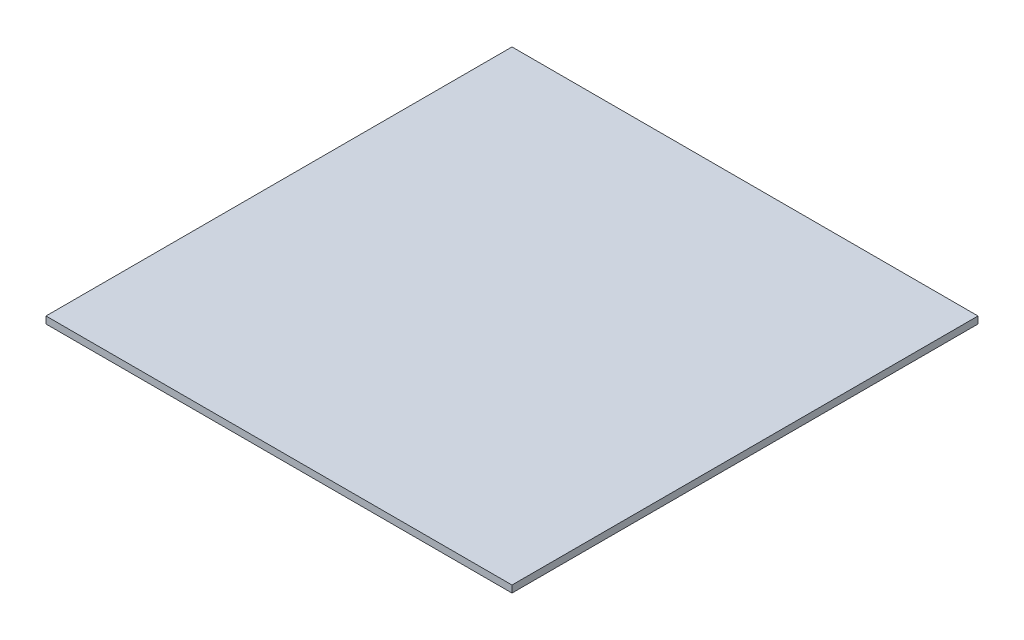
ISO-10303-21;
HEADER;
FILE_DESCRIPTION(('STEP AP214'),'2;1');
FILE_NAME('part.step','',(''),(''),'','','');
FILE_SCHEMA(('AUTOMOTIVE_DESIGN { 1 0 10303 214 1 1 1 1 }'));
ENDSEC;
DATA;
#1=APPLICATION_CONTEXT('core data for automotive mechanical design processes');
#2=APPLICATION_PROTOCOL_DEFINITION('international standard','automotive_design',2000,#1);
#3=PRODUCT_CONTEXT('',#1,'mechanical');
#4=PRODUCT('Part','Part','',(#3));
#5=PRODUCT_RELATED_PRODUCT_CATEGORY('part','',(#4));
#6=PRODUCT_DEFINITION_FORMATION('','',#4);
#7=PRODUCT_DEFINITION_CONTEXT('part definition',#1,'design');
#8=PRODUCT_DEFINITION('design','',#6,#7);
#9=PRODUCT_DEFINITION_SHAPE('','',#8);
#10=(LENGTH_UNIT() NAMED_UNIT(*) SI_UNIT(.MILLI.,.METRE.));
#11=(NAMED_UNIT(*) PLANE_ANGLE_UNIT() SI_UNIT($,.RADIAN.));
#12=(NAMED_UNIT(*) SI_UNIT($,.STERADIAN.) SOLID_ANGLE_UNIT());
#13=UNCERTAINTY_MEASURE_WITH_UNIT(LENGTH_MEASURE(1.E-05),#10,'distance_accuracy_value','');
#14=(GEOMETRIC_REPRESENTATION_CONTEXT(3) GLOBAL_UNCERTAINTY_ASSIGNED_CONTEXT((#13)) GLOBAL_UNIT_ASSIGNED_CONTEXT((#10,
#11,#12)) REPRESENTATION_CONTEXT('',''));
#15=CARTESIAN_POINT('',(0.,0.,0.));
#16=DIRECTION('',(0.,0.,1.));
#17=DIRECTION('',(1.,0.,0.));
#18=AXIS2_PLACEMENT_3D('',#15,#16,#17);
#19=CARTESIAN_POINT('',(25.4,0.762,25.4));
#20=DIRECTION('',(-1.,0.,0.));
#21=DIRECTION('',(0.,0.,1.));
#22=AXIS2_PLACEMENT_3D('',#19,#20,#21);
#23=PLANE('',#22);
#24=DIRECTION('',(0.,0.,-1.));
#25=VECTOR('',#24,1.);
#26=CARTESIAN_POINT('',(25.4,0.,25.4));
#27=LINE('',#26,#25);
#28=CARTESIAN_POINT('',(25.4,0.,25.4));
#29=VERTEX_POINT('',#28);
#30=CARTESIAN_POINT('',(25.4,0.,-25.4));
#31=VERTEX_POINT('',#30);
#32=EDGE_CURVE('E108',#29,#31,#27,.T.);
#33=ORIENTED_EDGE('',*,*,#32,.T.);
#34=DIRECTION('',(0.,-1.,0.));
#35=VECTOR('',#34,1.);
#36=CARTESIAN_POINT('',(25.4,0.762,-25.4));
#37=LINE('',#36,#35);
#38=CARTESIAN_POINT('',(25.4,0.762,-25.4));
#39=VERTEX_POINT('',#38);
#40=EDGE_CURVE('E11',#39,#31,#37,.T.);
#41=ORIENTED_EDGE('',*,*,#40,.F.);
#42=DIRECTION('',(0.,0.,-1.));
#43=VECTOR('',#42,1.);
#44=CARTESIAN_POINT('',(25.4,0.762,25.4));
#45=LINE('',#44,#43);
#46=CARTESIAN_POINT('',(25.4,0.762,25.4));
#47=VERTEX_POINT('',#46);
#48=EDGE_CURVE('E96',#47,#39,#45,.T.);
#49=ORIENTED_EDGE('',*,*,#48,.F.);
#50=DIRECTION('',(0.,-1.,0.));
#51=VECTOR('',#50,1.);
#52=CARTESIAN_POINT('',(25.4,0.762,25.4));
#53=LINE('',#52,#51);
#54=EDGE_CURVE('E104',#47,#29,#53,.T.);
#55=ORIENTED_EDGE('',*,*,#54,.T.);
#56=EDGE_LOOP('',(#33,#41,#49,#55));
#57=FACE_BOUND('',#56,.T.);
#58=ADVANCED_FACE('F45',(#57),#23,.F.);
#59=CARTESIAN_POINT('',(-25.4,0.762,-25.4));
#60=DIRECTION('',(0.,0.,1.));
#61=DIRECTION('',(1.,0.,0.));
#62=AXIS2_PLACEMENT_3D('',#59,#60,#61);
#63=PLANE('',#62);
#64=DIRECTION('',(-1.,0.,0.));
#65=VECTOR('',#64,1.);
#66=CARTESIAN_POINT('',(-25.4,0.,-25.4));
#67=LINE('',#66,#65);
#68=CARTESIAN_POINT('',(-25.4,0.,-25.4));
#69=VERTEX_POINT('',#68);
#70=EDGE_CURVE('E100',#31,#69,#67,.T.);
#71=ORIENTED_EDGE('',*,*,#70,.T.);
#72=DIRECTION('',(0.,-1.,0.));
#73=VECTOR('',#72,1.);
#74=CARTESIAN_POINT('',(-25.4,0.762,-25.4));
#75=LINE('',#74,#73);
#76=CARTESIAN_POINT('',(-25.4,0.762,-25.4));
#77=VERTEX_POINT('',#76);
#78=EDGE_CURVE('E53',#77,#69,#75,.T.);
#79=ORIENTED_EDGE('',*,*,#78,.F.);
#80=DIRECTION('',(-1.,0.,0.));
#81=VECTOR('',#80,1.);
#82=CARTESIAN_POINT('',(-25.4,0.762,-25.4));
#83=LINE('',#82,#81);
#84=EDGE_CURVE('E91',#39,#77,#83,.T.);
#85=ORIENTED_EDGE('',*,*,#84,.F.);
#86=ORIENTED_EDGE('',*,*,#40,.T.);
#87=EDGE_LOOP('',(#71,#79,#85,#86));
#88=FACE_BOUND('',#87,.T.);
#89=ADVANCED_FACE('F99',(#88),#63,.F.);
#90=CARTESIAN_POINT('',(-25.4,0.762,25.4));
#91=DIRECTION('',(1.,0.,0.));
#92=DIRECTION('',(0.,0.,-1.));
#93=AXIS2_PLACEMENT_3D('',#90,#91,#92);
#94=PLANE('',#93);
#95=DIRECTION('',(0.,0.,1.));
#96=VECTOR('',#95,1.);
#97=CARTESIAN_POINT('',(-25.4,0.,25.4));
#98=LINE('',#97,#96);
#99=CARTESIAN_POINT('',(-25.4,0.,25.4));
#100=VERTEX_POINT('',#99);
#101=EDGE_CURVE('E78',#69,#100,#98,.T.);
#102=ORIENTED_EDGE('',*,*,#101,.T.);
#103=DIRECTION('',(0.,-1.,0.));
#104=VECTOR('',#103,1.);
#105=CARTESIAN_POINT('',(-25.4,0.762,25.4));
#106=LINE('',#105,#104);
#107=CARTESIAN_POINT('',(-25.4,0.762,25.4));
#108=VERTEX_POINT('',#107);
#109=EDGE_CURVE('E101',#108,#100,#106,.T.);
#110=ORIENTED_EDGE('',*,*,#109,.F.);
#111=DIRECTION('',(0.,0.,1.));
#112=VECTOR('',#111,1.);
#113=CARTESIAN_POINT('',(-25.4,0.762,25.4));
#114=LINE('',#113,#112);
#115=EDGE_CURVE('E94',#77,#108,#114,.T.);
#116=ORIENTED_EDGE('',*,*,#115,.F.);
#117=ORIENTED_EDGE('',*,*,#78,.T.);
#118=EDGE_LOOP('',(#102,#110,#116,#117));
#119=FACE_BOUND('',#118,.T.);
#120=ADVANCED_FACE('F102',(#119),#94,.F.);
#121=CARTESIAN_POINT('',(-25.4,0.762,25.4));
#122=DIRECTION('',(0.,0.,-1.));
#123=DIRECTION('',(-1.,0.,0.));
#124=AXIS2_PLACEMENT_3D('',#121,#122,#123);
#125=PLANE('',#124);
#126=DIRECTION('',(1.,0.,0.));
#127=VECTOR('',#126,1.);
#128=CARTESIAN_POINT('',(-25.4,0.,25.4));
#129=LINE('',#128,#127);
#130=EDGE_CURVE('E84',#100,#29,#129,.T.);
#131=ORIENTED_EDGE('',*,*,#130,.T.);
#132=ORIENTED_EDGE('',*,*,#54,.F.);
#133=DIRECTION('',(1.,0.,0.));
#134=VECTOR('',#133,1.);
#135=CARTESIAN_POINT('',(-25.4,0.762,25.4));
#136=LINE('',#135,#134);
#137=EDGE_CURVE('E61',#108,#47,#136,.T.);
#138=ORIENTED_EDGE('',*,*,#137,.F.);
#139=ORIENTED_EDGE('',*,*,#109,.T.);
#140=EDGE_LOOP('',(#131,#132,#138,#139));
#141=FACE_BOUND('',#140,.T.);
#142=ADVANCED_FACE('F115',(#141),#125,.F.);
#143=CARTESIAN_POINT('',(0.,0.762,0.));
#144=DIRECTION('',(0.,-1.,0.));
#145=DIRECTION('',(0.,0.,-1.));
#146=AXIS2_PLACEMENT_3D('',#143,#144,#145);
#147=PLANE('',#146);
#148=ORIENTED_EDGE('',*,*,#48,.T.);
#149=ORIENTED_EDGE('',*,*,#84,.T.);
#150=ORIENTED_EDGE('',*,*,#115,.T.);
#151=ORIENTED_EDGE('',*,*,#137,.T.);
#152=EDGE_LOOP('',(#148,#149,#150,#151));
#153=FACE_BOUND('',#152,.T.);
#154=ADVANCED_FACE('F92',(#153),#147,.F.);
#155=CARTESIAN_POINT('',(0.,0.,0.));
#156=DIRECTION('',(0.,-1.,0.));
#157=DIRECTION('',(0.,0.,-1.));
#158=AXIS2_PLACEMENT_3D('',#155,#156,#157);
#159=PLANE('',#158);
#160=ORIENTED_EDGE('',*,*,#32,.F.);
#161=ORIENTED_EDGE('',*,*,#130,.F.);
#162=ORIENTED_EDGE('',*,*,#101,.F.);
#163=ORIENTED_EDGE('',*,*,#70,.F.);
#164=EDGE_LOOP('',(#160,#161,#162,#163));
#165=FACE_BOUND('',#164,.T.);
#166=ADVANCED_FACE('F118',(#165),#159,.T.);
#167=CLOSED_SHELL('',(#58,#89,#120,#142,#154,#166));
#168=MANIFOLD_SOLID_BREP('B2',#167);
#169=ADVANCED_BREP_SHAPE_REPRESENTATION('',(#18,#168),#14);
#170=SHAPE_DEFINITION_REPRESENTATION(#9,#169);
ENDSEC;
END-ISO-10303-21;
